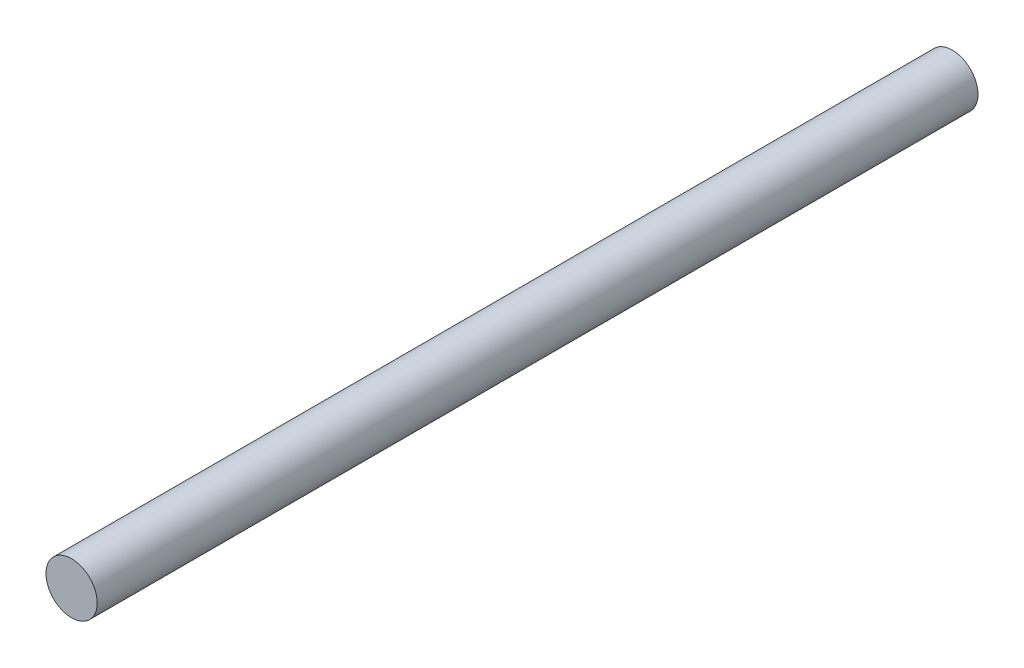
ISO-10303-21;
HEADER;
FILE_DESCRIPTION(('STEP AP214'),'2;1');
FILE_NAME('part.step','',(''),(''),'','','');
FILE_SCHEMA(('AUTOMOTIVE_DESIGN { 1 0 10303 214 1 1 1 1 }'));
ENDSEC;
DATA;
#1=APPLICATION_CONTEXT('core data for automotive mechanical design processes');
#2=APPLICATION_PROTOCOL_DEFINITION('international standard','automotive_design',2000,#1);
#3=PRODUCT_CONTEXT('',#1,'mechanical');
#4=PRODUCT('Part','Part','',(#3));
#5=PRODUCT_RELATED_PRODUCT_CATEGORY('part','',(#4));
#6=PRODUCT_DEFINITION_FORMATION('','',#4);
#7=PRODUCT_DEFINITION_CONTEXT('part definition',#1,'design');
#8=PRODUCT_DEFINITION('design','',#6,#7);
#9=PRODUCT_DEFINITION_SHAPE('','',#8);
#10=(LENGTH_UNIT() NAMED_UNIT(*) SI_UNIT(.MILLI.,.METRE.));
#11=(NAMED_UNIT(*) PLANE_ANGLE_UNIT() SI_UNIT($,.RADIAN.));
#12=(NAMED_UNIT(*) SI_UNIT($,.STERADIAN.) SOLID_ANGLE_UNIT());
#13=UNCERTAINTY_MEASURE_WITH_UNIT(LENGTH_MEASURE(1.E-05),#10,'distance_accuracy_value','');
#14=(GEOMETRIC_REPRESENTATION_CONTEXT(3) GLOBAL_UNCERTAINTY_ASSIGNED_CONTEXT((#13)) GLOBAL_UNIT_ASSIGNED_CONTEXT((#10,
#11,#12)) REPRESENTATION_CONTEXT('',''));
#15=CARTESIAN_POINT('',(0.,0.,0.));
#16=DIRECTION('',(0.,0.,1.));
#17=DIRECTION('',(1.,0.,0.));
#18=AXIS2_PLACEMENT_3D('',#15,#16,#17);
#19=CARTESIAN_POINT('',(0.,0.,137.5));
#20=DIRECTION('',(0.,0.,-1.));
#21=DIRECTION('',(-1.,0.,0.));
#22=AXIS2_PLACEMENT_3D('',#19,#20,#21);
#23=CYLINDRICAL_SURFACE('',#22,4.);
#24=CARTESIAN_POINT('',(0.,0.,137.5));
#25=DIRECTION('',(0.,0.,1.));
#26=DIRECTION('',(1.,0.,0.));
#27=AXIS2_PLACEMENT_3D('',#24,#25,#26);
#28=CIRCLE('',#27,4.);
#29=CARTESIAN_POINT('',(4.,0.,137.5));
#30=VERTEX_POINT('',#29);
#31=EDGE_CURVE('E10',#30,#30,#28,.T.);
#32=ORIENTED_EDGE('',*,*,#31,.F.);
#33=EDGE_LOOP('',(#32));
#34=FACE_BOUND('',#33,.T.);
#35=CARTESIAN_POINT('',(0.,0.,0.));
#36=DIRECTION('',(0.,0.,1.));
#37=DIRECTION('',(1.,0.,0.));
#38=AXIS2_PLACEMENT_3D('',#35,#36,#37);
#39=CIRCLE('',#38,4.);
#40=CARTESIAN_POINT('',(4.,0.,0.));
#41=VERTEX_POINT('',#40);
#42=EDGE_CURVE('E34',#41,#41,#39,.T.);
#43=ORIENTED_EDGE('',*,*,#42,.T.);
#44=EDGE_LOOP('',(#43));
#45=FACE_BOUND('',#44,.T.);
#46=ADVANCED_FACE('F31',(#34,#45),#23,.T.);
#47=CARTESIAN_POINT('',(0.,0.,137.5));
#48=DIRECTION('',(0.,0.,1.));
#49=DIRECTION('',(1.,0.,0.));
#50=AXIS2_PLACEMENT_3D('',#47,#48,#49);
#51=PLANE('',#50);
#52=ORIENTED_EDGE('',*,*,#31,.T.);
#53=EDGE_LOOP('',(#52));
#54=FACE_BOUND('',#53,.T.);
#55=ADVANCED_FACE('F46',(#54),#51,.T.);
#56=CARTESIAN_POINT('',(0.,0.,0.));
#57=DIRECTION('',(0.,0.,1.));
#58=DIRECTION('',(1.,0.,0.));
#59=AXIS2_PLACEMENT_3D('',#56,#57,#58);
#60=PLANE('',#59);
#61=ORIENTED_EDGE('',*,*,#42,.F.);
#62=EDGE_LOOP('',(#61));
#63=FACE_BOUND('',#62,.T.);
#64=ADVANCED_FACE('F44',(#63),#60,.F.);
#65=CLOSED_SHELL('',(#46,#55,#64));
#66=MANIFOLD_SOLID_BREP('B2',#65);
#67=ADVANCED_BREP_SHAPE_REPRESENTATION('',(#18,#66),#14);
#68=SHAPE_DEFINITION_REPRESENTATION(#9,#67);
ENDSEC;
END-ISO-10303-21;
